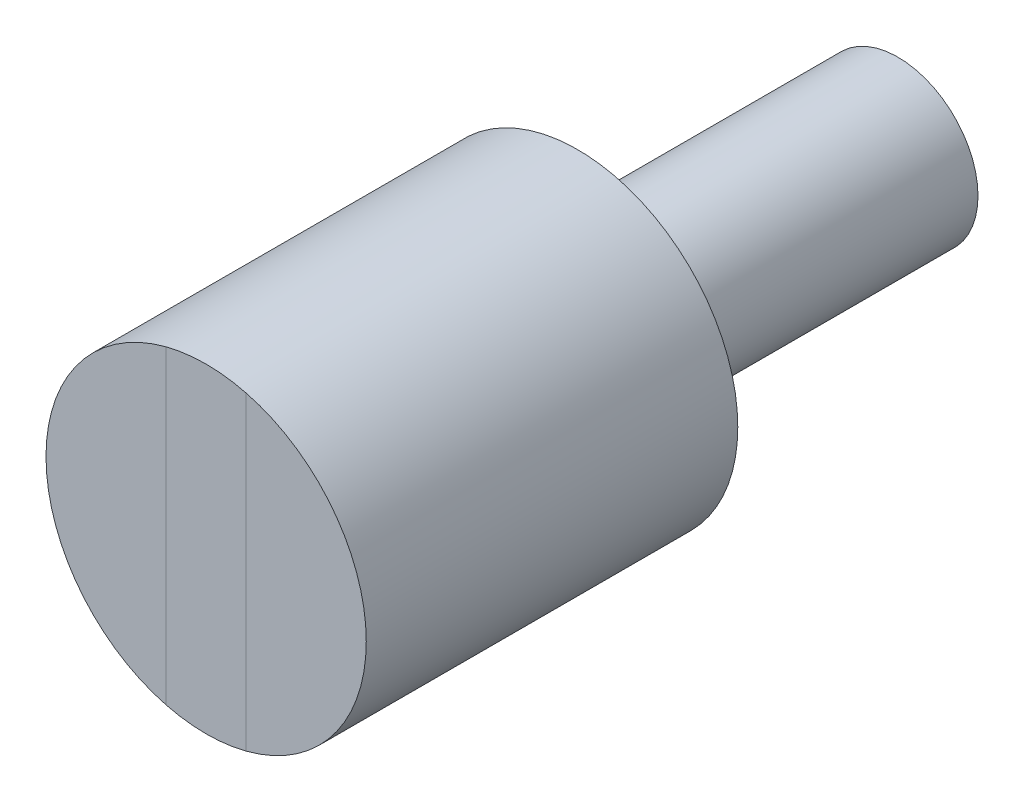
ISO-10303-21;
HEADER;
FILE_DESCRIPTION(('STEP AP214'),'2;1');
FILE_NAME('part.step','',(''),(''),'','','');
FILE_SCHEMA(('AUTOMOTIVE_DESIGN { 1 0 10303 214 1 1 1 1 }'));
ENDSEC;
DATA;
#1=APPLICATION_CONTEXT('core data for automotive mechanical design processes');
#2=APPLICATION_PROTOCOL_DEFINITION('international standard','automotive_design',2000,#1);
#3=PRODUCT_CONTEXT('',#1,'mechanical');
#4=PRODUCT('Part','Part','',(#3));
#5=PRODUCT_RELATED_PRODUCT_CATEGORY('part','',(#4));
#6=PRODUCT_DEFINITION_FORMATION('','',#4);
#7=PRODUCT_DEFINITION_CONTEXT('part definition',#1,'design');
#8=PRODUCT_DEFINITION('design','',#6,#7);
#9=PRODUCT_DEFINITION_SHAPE('','',#8);
#10=(LENGTH_UNIT() NAMED_UNIT(*) SI_UNIT(.MILLI.,.METRE.));
#11=(NAMED_UNIT(*) PLANE_ANGLE_UNIT() SI_UNIT($,.RADIAN.));
#12=(NAMED_UNIT(*) SI_UNIT($,.STERADIAN.) SOLID_ANGLE_UNIT());
#13=UNCERTAINTY_MEASURE_WITH_UNIT(LENGTH_MEASURE(1.E-05),#10,'distance_accuracy_value','');
#14=(GEOMETRIC_REPRESENTATION_CONTEXT(3) GLOBAL_UNCERTAINTY_ASSIGNED_CONTEXT((#13)) GLOBAL_UNIT_ASSIGNED_CONTEXT((#10,
#11,#12)) REPRESENTATION_CONTEXT('',''));
#15=CARTESIAN_POINT('',(0.,0.,0.));
#16=DIRECTION('',(0.,0.,1.));
#17=DIRECTION('',(1.,0.,0.));
#18=AXIS2_PLACEMENT_3D('',#15,#16,#17);
#19=CARTESIAN_POINT('',(0.,0.,99.6));
#20=DIRECTION('',(0.,0.,1.));
#21=DIRECTION('',(1.,0.,0.));
#22=AXIS2_PLACEMENT_3D('',#19,#20,#21);
#23=PLANE('',#22);
#24=DIRECTION('',(0.,1.,0.));
#25=VECTOR('',#24,1.);
#26=CARTESIAN_POINT('',(7.5,29.0473750965556,99.6));
#27=LINE('',#26,#25);
#28=CARTESIAN_POINT('',(7.5,-29.0473750965556,99.6));
#29=VERTEX_POINT('',#28);
#30=CARTESIAN_POINT('',(7.5,29.0473750965556,99.6));
#31=VERTEX_POINT('',#30);
#32=EDGE_CURVE('E48',#29,#31,#27,.T.);
#33=ORIENTED_EDGE('',*,*,#32,.F.);
#34=CARTESIAN_POINT('',(0.,0.,99.6));
#35=DIRECTION('',(0.,0.,1.));
#36=DIRECTION('',(1.,0.,0.));
#37=AXIS2_PLACEMENT_3D('',#34,#35,#36);
#38=CIRCLE('',#37,30.);
#39=EDGE_CURVE('E101',#29,#31,#38,.T.);
#40=ORIENTED_EDGE('',*,*,#39,.T.);
#41=EDGE_LOOP('',(#33,#40));
#42=FACE_BOUND('',#41,.T.);
#43=ADVANCED_FACE('F34',(#42),#23,.T.);
#44=CARTESIAN_POINT('',(0.,0.,30.));
#45=DIRECTION('',(0.,0.,-1.));
#46=DIRECTION('',(-1.,0.,0.));
#47=AXIS2_PLACEMENT_3D('',#44,#45,#46);
#48=CYLINDRICAL_SURFACE('',#47,15.);
#49=CARTESIAN_POINT('',(0.,0.,30.));
#50=DIRECTION('',(0.,0.,1.));
#51=DIRECTION('',(1.,0.,0.));
#52=AXIS2_PLACEMENT_3D('',#49,#50,#51);
#53=CIRCLE('',#52,15.);
#54=CARTESIAN_POINT('',(15.,0.,30.));
#55=VERTEX_POINT('',#54);
#56=EDGE_CURVE('E11',#55,#55,#53,.T.);
#57=ORIENTED_EDGE('',*,*,#56,.F.);
#58=EDGE_LOOP('',(#57));
#59=FACE_BOUND('',#58,.T.);
#60=CARTESIAN_POINT('',(0.,0.,-30.));
#61=DIRECTION('',(0.,0.,1.));
#62=DIRECTION('',(1.,0.,0.));
#63=AXIS2_PLACEMENT_3D('',#60,#61,#62);
#64=CIRCLE('',#63,15.);
#65=CARTESIAN_POINT('',(15.,0.,-30.));
#66=VERTEX_POINT('',#65);
#67=EDGE_CURVE('E38',#66,#66,#64,.T.);
#68=ORIENTED_EDGE('',*,*,#67,.T.);
#69=EDGE_LOOP('',(#68));
#70=FACE_BOUND('',#69,.T.);
#71=ADVANCED_FACE('F36',(#59,#70),#48,.T.);
#72=CARTESIAN_POINT('',(0.,0.,-30.));
#73=DIRECTION('',(0.,0.,1.));
#74=DIRECTION('',(1.,0.,0.));
#75=AXIS2_PLACEMENT_3D('',#72,#73,#74);
#76=PLANE('',#75);
#77=ORIENTED_EDGE('',*,*,#67,.F.);
#78=EDGE_LOOP('',(#77));
#79=FACE_BOUND('',#78,.T.);
#80=ADVANCED_FACE('F111',(#79),#76,.F.);
#81=CARTESIAN_POINT('',(0.,0.,99.6));
#82=DIRECTION('',(0.,0.,-1.));
#83=DIRECTION('',(-1.,0.,0.));
#84=AXIS2_PLACEMENT_3D('',#81,#82,#83);
#85=CYLINDRICAL_SURFACE('',#84,30.);
#86=CARTESIAN_POINT('',(-7.5,29.0473750965556,99.6));
#87=VERTEX_POINT('',#86);
#88=CARTESIAN_POINT('',(-7.5,-29.0473750965556,99.6));
#89=VERTEX_POINT('',#88);
#90=EDGE_CURVE('E97',#87,#89,#38,.T.);
#91=ORIENTED_EDGE('',*,*,#90,.F.);
#92=DIRECTION('',(0.,0.,-1.));
#93=VECTOR('',#92,1.);
#94=CARTESIAN_POINT('',(-7.5,29.0473750965556,99.601));
#95=LINE('',#94,#93);
#96=CARTESIAN_POINT('',(-7.5,29.0473750965556,99.601));
#97=VERTEX_POINT('',#96);
#98=EDGE_CURVE('E79',#97,#87,#95,.T.);
#99=ORIENTED_EDGE('',*,*,#98,.F.);
#100=CARTESIAN_POINT('',(0.,0.,99.601));
#101=DIRECTION('',(0.,0.,1.));
#102=DIRECTION('',(1.,0.,0.));
#103=AXIS2_PLACEMENT_3D('',#100,#101,#102);
#104=CIRCLE('',#103,30.);
#105=CARTESIAN_POINT('',(7.5,29.0473750965556,99.601));
#106=VERTEX_POINT('',#105);
#107=EDGE_CURVE('E85',#106,#97,#104,.T.);
#108=ORIENTED_EDGE('',*,*,#107,.F.);
#109=DIRECTION('',(0.,0.,-1.));
#110=VECTOR('',#109,1.);
#111=CARTESIAN_POINT('',(7.5,29.0473750965556,99.601));
#112=LINE('',#111,#110);
#113=EDGE_CURVE('E215',#106,#31,#112,.T.);
#114=ORIENTED_EDGE('',*,*,#113,.T.);
#115=ORIENTED_EDGE('',*,*,#39,.F.);
#116=DIRECTION('',(0.,0.,-1.));
#117=VECTOR('',#116,1.);
#118=CARTESIAN_POINT('',(7.50000000000001,-29.0473750965556,99.601));
#119=LINE('',#118,#117);
#120=CARTESIAN_POINT('',(7.50000000000001,-29.0473750965556,99.601));
#121=VERTEX_POINT('',#120);
#122=EDGE_CURVE('E103',#121,#29,#119,.T.);
#123=ORIENTED_EDGE('',*,*,#122,.F.);
#124=CARTESIAN_POINT('',(0.,0.,99.601));
#125=DIRECTION('',(0.,0.,1.));
#126=DIRECTION('',(-1.,0.,0.));
#127=AXIS2_PLACEMENT_3D('',#124,#125,#126);
#128=CIRCLE('',#127,30.);
#129=CARTESIAN_POINT('',(-7.5,-29.0473750965556,99.601));
#130=VERTEX_POINT('',#129);
#131=EDGE_CURVE('E84',#130,#121,#128,.T.);
#132=ORIENTED_EDGE('',*,*,#131,.F.);
#133=DIRECTION('',(0.,0.,-1.));
#134=VECTOR('',#133,1.);
#135=CARTESIAN_POINT('',(-7.5,-29.0473750965556,99.601));
#136=LINE('',#135,#134);
#137=EDGE_CURVE('E81',#130,#89,#136,.T.);
#138=ORIENTED_EDGE('',*,*,#137,.T.);
#139=EDGE_LOOP('',(#91,#99,#108,#114,#115,#123,#132,#138));
#140=FACE_BOUND('',#139,.T.);
#141=CARTESIAN_POINT('',(0.,0.,30.));
#142=DIRECTION('',(0.,0.,1.));
#143=DIRECTION('',(1.,0.,0.));
#144=AXIS2_PLACEMENT_3D('',#141,#142,#143);
#145=CIRCLE('',#144,30.);
#146=CARTESIAN_POINT('',(30.,0.,30.));
#147=VERTEX_POINT('',#146);
#148=EDGE_CURVE('E98',#147,#147,#145,.T.);
#149=ORIENTED_EDGE('',*,*,#148,.T.);
#150=EDGE_LOOP('',(#149));
#151=FACE_BOUND('',#150,.T.);
#152=ADVANCED_FACE('F95',(#140,#151),#85,.T.);
#153=DIRECTION('',(0.,-1.,0.));
#154=VECTOR('',#153,1.);
#155=CARTESIAN_POINT('',(-7.5,29.0473750965556,99.6));
#156=LINE('',#155,#154);
#157=EDGE_CURVE('E55',#87,#89,#156,.T.);
#158=ORIENTED_EDGE('',*,*,#157,.F.);
#159=ORIENTED_EDGE('',*,*,#90,.T.);
#160=EDGE_LOOP('',(#158,#159));
#161=FACE_BOUND('',#160,.T.);
#162=ADVANCED_FACE('F117',(#161),#23,.T.);
#163=CARTESIAN_POINT('',(0.,0.,30.));
#164=DIRECTION('',(0.,0.,1.));
#165=DIRECTION('',(1.,0.,0.));
#166=AXIS2_PLACEMENT_3D('',#163,#164,#165);
#167=PLANE('',#166);
#168=ORIENTED_EDGE('',*,*,#56,.T.);
#169=EDGE_LOOP('',(#168));
#170=FACE_BOUND('',#169,.T.);
#171=ORIENTED_EDGE('',*,*,#148,.F.);
#172=EDGE_LOOP('',(#171));
#173=FACE_BOUND('',#172,.T.);
#174=ADVANCED_FACE('F127',(#170,#173),#167,.F.);
#175=CARTESIAN_POINT('',(-7.5,29.0473750965556,99.601));
#176=DIRECTION('',(1.,0.,0.));
#177=DIRECTION('',(0.,0.,-1.));
#178=AXIS2_PLACEMENT_3D('',#175,#176,#177);
#179=PLANE('',#178);
#180=ORIENTED_EDGE('',*,*,#157,.T.);
#181=ORIENTED_EDGE('',*,*,#137,.F.);
#182=DIRECTION('',(0.,-1.,0.));
#183=VECTOR('',#182,1.);
#184=CARTESIAN_POINT('',(-7.5,29.0473750965556,99.601));
#185=LINE('',#184,#183);
#186=EDGE_CURVE('E75',#97,#130,#185,.T.);
#187=ORIENTED_EDGE('',*,*,#186,.F.);
#188=ORIENTED_EDGE('',*,*,#98,.T.);
#189=EDGE_LOOP('',(#180,#181,#187,#188));
#190=FACE_BOUND('',#189,.T.);
#191=ADVANCED_FACE('F77',(#190),#179,.F.);
#192=CARTESIAN_POINT('',(7.5,29.0473750965556,99.601));
#193=DIRECTION('',(-1.,0.,0.));
#194=DIRECTION('',(0.,0.,1.));
#195=AXIS2_PLACEMENT_3D('',#192,#193,#194);
#196=PLANE('',#195);
#197=ORIENTED_EDGE('',*,*,#32,.T.);
#198=ORIENTED_EDGE('',*,*,#113,.F.);
#199=DIRECTION('',(0.,1.,0.));
#200=VECTOR('',#199,1.);
#201=CARTESIAN_POINT('',(7.5,29.0473750965556,99.601));
#202=LINE('',#201,#200);
#203=EDGE_CURVE('E90',#121,#106,#202,.T.);
#204=ORIENTED_EDGE('',*,*,#203,.F.);
#205=ORIENTED_EDGE('',*,*,#122,.T.);
#206=EDGE_LOOP('',(#197,#198,#204,#205));
#207=FACE_BOUND('',#206,.T.);
#208=ADVANCED_FACE('F135',(#207),#196,.F.);
#209=CARTESIAN_POINT('',(0.,0.,99.601));
#210=DIRECTION('',(0.,0.,1.));
#211=DIRECTION('',(1.,0.,0.));
#212=AXIS2_PLACEMENT_3D('',#209,#210,#211);
#213=PLANE('',#212);
#214=ORIENTED_EDGE('',*,*,#107,.T.);
#215=ORIENTED_EDGE('',*,*,#186,.T.);
#216=ORIENTED_EDGE('',*,*,#131,.T.);
#217=ORIENTED_EDGE('',*,*,#203,.T.);
#218=EDGE_LOOP('',(#214,#215,#216,#217));
#219=FACE_BOUND('',#218,.T.);
#220=ADVANCED_FACE('F88',(#219),#213,.T.);
#221=CLOSED_SHELL('',(#43,#71,#80,#152,#162,#174,#191,#208,#220));
#222=MANIFOLD_SOLID_BREP('B2',#221);
#223=ADVANCED_BREP_SHAPE_REPRESENTATION('',(#18,#222),#14);
#224=SHAPE_DEFINITION_REPRESENTATION(#9,#223);
ENDSEC;
END-ISO-10303-21;
